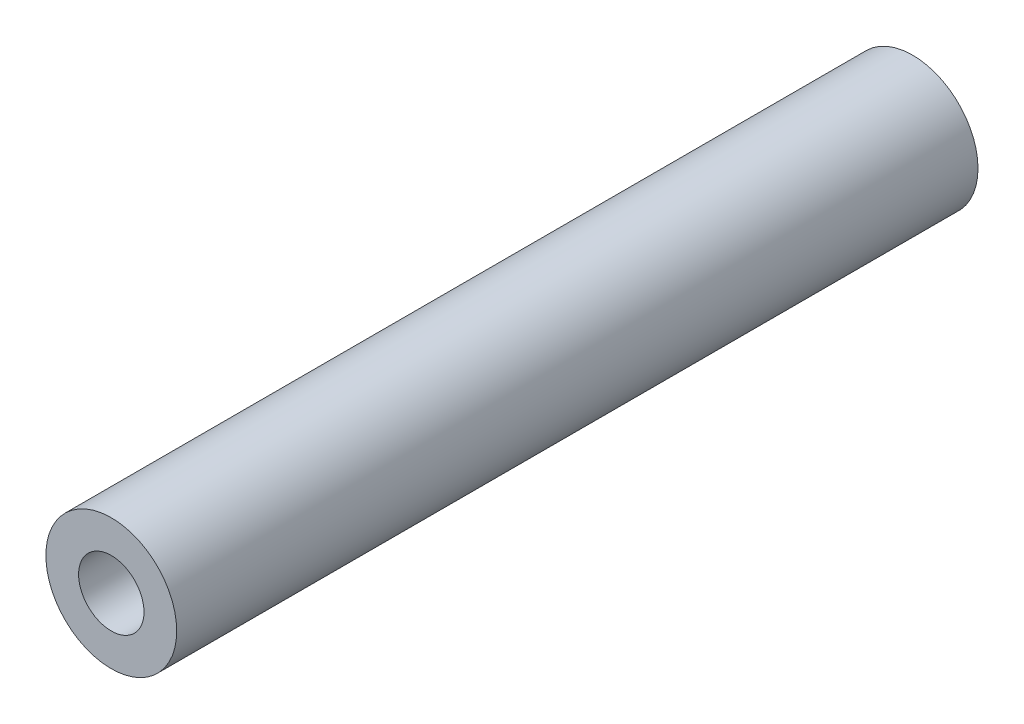
ISO-10303-21;
HEADER;
FILE_DESCRIPTION(('STEP AP214'),'2;1');
FILE_NAME('part.step','',(''),(''),'','','');
FILE_SCHEMA(('AUTOMOTIVE_DESIGN { 1 0 10303 214 1 1 1 1 }'));
ENDSEC;
DATA;
#1=APPLICATION_CONTEXT('core data for automotive mechanical design processes');
#2=APPLICATION_PROTOCOL_DEFINITION('international standard','automotive_design',2000,#1);
#3=PRODUCT_CONTEXT('',#1,'mechanical');
#4=PRODUCT('Part','Part','',(#3));
#5=PRODUCT_RELATED_PRODUCT_CATEGORY('part','',(#4));
#6=PRODUCT_DEFINITION_FORMATION('','',#4);
#7=PRODUCT_DEFINITION_CONTEXT('part definition',#1,'design');
#8=PRODUCT_DEFINITION('design','',#6,#7);
#9=PRODUCT_DEFINITION_SHAPE('','',#8);
#10=(LENGTH_UNIT() NAMED_UNIT(*) SI_UNIT(.MILLI.,.METRE.));
#11=(NAMED_UNIT(*) PLANE_ANGLE_UNIT() SI_UNIT($,.RADIAN.));
#12=(NAMED_UNIT(*) SI_UNIT($,.STERADIAN.) SOLID_ANGLE_UNIT());
#13=UNCERTAINTY_MEASURE_WITH_UNIT(LENGTH_MEASURE(1.E-05),#10,'distance_accuracy_value','');
#14=(GEOMETRIC_REPRESENTATION_CONTEXT(3) GLOBAL_UNCERTAINTY_ASSIGNED_CONTEXT((#13)) GLOBAL_UNIT_ASSIGNED_CONTEXT((#10,
#11,#12)) REPRESENTATION_CONTEXT('',''));
#15=CARTESIAN_POINT('',(0.,0.,0.));
#16=DIRECTION('',(0.,0.,1.));
#17=DIRECTION('',(1.,0.,0.));
#18=AXIS2_PLACEMENT_3D('',#15,#16,#17);
#19=CARTESIAN_POINT('',(0.,0.,49.));
#20=DIRECTION('',(0.,0.,-1.));
#21=DIRECTION('',(-1.,0.,0.));
#22=AXIS2_PLACEMENT_3D('',#19,#20,#21);
#23=CYLINDRICAL_SURFACE('',#22,4.);
#24=CARTESIAN_POINT('',(0.,0.,49.));
#25=DIRECTION('',(0.,0.,1.));
#26=DIRECTION('',(1.,0.,0.));
#27=AXIS2_PLACEMENT_3D('',#24,#25,#26);
#28=CIRCLE('',#27,4.);
#29=CARTESIAN_POINT('',(4.,0.,49.));
#30=VERTEX_POINT('',#29);
#31=EDGE_CURVE('E10',#30,#30,#28,.T.);
#32=ORIENTED_EDGE('',*,*,#31,.F.);
#33=EDGE_LOOP('',(#32));
#34=FACE_BOUND('',#33,.T.);
#35=CARTESIAN_POINT('',(0.,0.,0.));
#36=DIRECTION('',(0.,0.,1.));
#37=DIRECTION('',(1.,0.,0.));
#38=AXIS2_PLACEMENT_3D('',#35,#36,#37);
#39=CIRCLE('',#38,4.);
#40=CARTESIAN_POINT('',(4.,0.,0.));
#41=VERTEX_POINT('',#40);
#42=EDGE_CURVE('E34',#41,#41,#39,.T.);
#43=ORIENTED_EDGE('',*,*,#42,.T.);
#44=EDGE_LOOP('',(#43));
#45=FACE_BOUND('',#44,.T.);
#46=ADVANCED_FACE('F31',(#34,#45),#23,.T.);
#47=CARTESIAN_POINT('',(0.,0.,49.));
#48=DIRECTION('',(0.,0.,1.));
#49=DIRECTION('',(1.,0.,0.));
#50=AXIS2_PLACEMENT_3D('',#47,#48,#49);
#51=PLANE('',#50);
#52=CARTESIAN_POINT('',(0.,0.,49.));
#53=DIRECTION('',(0.,0.,1.));
#54=DIRECTION('',(1.,0.,0.));
#55=AXIS2_PLACEMENT_3D('',#52,#53,#54);
#56=CIRCLE('',#55,2.);
#57=CARTESIAN_POINT('',(2.,0.,49.));
#58=VERTEX_POINT('',#57);
#59=EDGE_CURVE('E43',#58,#58,#56,.T.);
#60=ORIENTED_EDGE('',*,*,#59,.F.);
#61=EDGE_LOOP('',(#60));
#62=FACE_BOUND('',#61,.T.);
#63=ORIENTED_EDGE('',*,*,#31,.T.);
#64=EDGE_LOOP('',(#63));
#65=FACE_BOUND('',#64,.T.);
#66=ADVANCED_FACE('F68',(#62,#65),#51,.T.);
#67=CARTESIAN_POINT('',(0.,0.,0.));
#68=DIRECTION('',(0.,0.,1.));
#69=DIRECTION('',(1.,0.,0.));
#70=AXIS2_PLACEMENT_3D('',#67,#68,#69);
#71=PLANE('',#70);
#72=CARTESIAN_POINT('',(0.,0.,0.));
#73=DIRECTION('',(0.,0.,-1.));
#74=DIRECTION('',(-1.,0.,0.));
#75=AXIS2_PLACEMENT_3D('',#72,#73,#74);
#76=CIRCLE('',#75,2.);
#77=CARTESIAN_POINT('',(-2.,0.,0.));
#78=VERTEX_POINT('',#77);
#79=EDGE_CURVE('E49',#78,#78,#76,.T.);
#80=ORIENTED_EDGE('',*,*,#79,.F.);
#81=EDGE_LOOP('',(#80));
#82=FACE_BOUND('',#81,.T.);
#83=ORIENTED_EDGE('',*,*,#42,.F.);
#84=EDGE_LOOP('',(#83));
#85=FACE_BOUND('',#84,.T.);
#86=ADVANCED_FACE('F64',(#82,#85),#71,.F.);
#87=CARTESIAN_POINT('',(0.,0.,39.));
#88=DIRECTION('',(0.,0.,1.));
#89=DIRECTION('',(1.,0.,0.));
#90=AXIS2_PLACEMENT_3D('',#87,#88,#89);
#91=CYLINDRICAL_SURFACE('',#90,2.);
#92=CARTESIAN_POINT('',(0.,0.,39.));
#93=DIRECTION('',(0.,0.,1.));
#94=DIRECTION('',(1.,0.,0.));
#95=AXIS2_PLACEMENT_3D('',#92,#93,#94);
#96=CIRCLE('',#95,2.);
#97=CARTESIAN_POINT('',(2.,0.,39.));
#98=VERTEX_POINT('',#97);
#99=EDGE_CURVE('E41',#98,#98,#96,.T.);
#100=ORIENTED_EDGE('',*,*,#99,.F.);
#101=EDGE_LOOP('',(#100));
#102=FACE_BOUND('',#101,.T.);
#103=ORIENTED_EDGE('',*,*,#59,.T.);
#104=EDGE_LOOP('',(#103));
#105=FACE_BOUND('',#104,.T.);
#106=ADVANCED_FACE('F67',(#102,#105),#91,.F.);
#107=CARTESIAN_POINT('',(0.,0.,39.));
#108=DIRECTION('',(0.,0.,1.));
#109=DIRECTION('',(1.,0.,0.));
#110=AXIS2_PLACEMENT_3D('',#107,#108,#109);
#111=PLANE('',#110);
#112=ORIENTED_EDGE('',*,*,#99,.T.);
#113=EDGE_LOOP('',(#112));
#114=FACE_BOUND('',#113,.T.);
#115=ADVANCED_FACE('F60',(#114),#111,.T.);
#116=CARTESIAN_POINT('',(0.,0.,10.));
#117=DIRECTION('',(0.,0.,-1.));
#118=DIRECTION('',(-1.,0.,0.));
#119=AXIS2_PLACEMENT_3D('',#116,#117,#118);
#120=CYLINDRICAL_SURFACE('',#119,2.);
#121=CARTESIAN_POINT('',(0.,0.,10.));
#122=DIRECTION('',(0.,0.,-1.));
#123=DIRECTION('',(-1.,0.,0.));
#124=AXIS2_PLACEMENT_3D('',#121,#122,#123);
#125=CIRCLE('',#124,2.);
#126=CARTESIAN_POINT('',(-2.,0.,10.));
#127=VERTEX_POINT('',#126);
#128=EDGE_CURVE('E46',#127,#127,#125,.T.);
#129=ORIENTED_EDGE('',*,*,#128,.F.);
#130=EDGE_LOOP('',(#129));
#131=FACE_BOUND('',#130,.T.);
#132=ORIENTED_EDGE('',*,*,#79,.T.);
#133=EDGE_LOOP('',(#132));
#134=FACE_BOUND('',#133,.T.);
#135=ADVANCED_FACE('F57',(#131,#134),#120,.F.);
#136=CARTESIAN_POINT('',(0.,0.,10.));
#137=DIRECTION('',(0.,0.,-1.));
#138=DIRECTION('',(-1.,0.,0.));
#139=AXIS2_PLACEMENT_3D('',#136,#137,#138);
#140=PLANE('',#139);
#141=ORIENTED_EDGE('',*,*,#128,.T.);
#142=EDGE_LOOP('',(#141));
#143=FACE_BOUND('',#142,.T.);
#144=ADVANCED_FACE('F55',(#143),#140,.T.);
#145=CLOSED_SHELL('',(#46,#66,#86,#106,#115,#135,#144));
#146=MANIFOLD_SOLID_BREP('B2',#145);
#147=ADVANCED_BREP_SHAPE_REPRESENTATION('',(#18,#146),#14);
#148=SHAPE_DEFINITION_REPRESENTATION(#9,#147);
ENDSEC;
END-ISO-10303-21;
